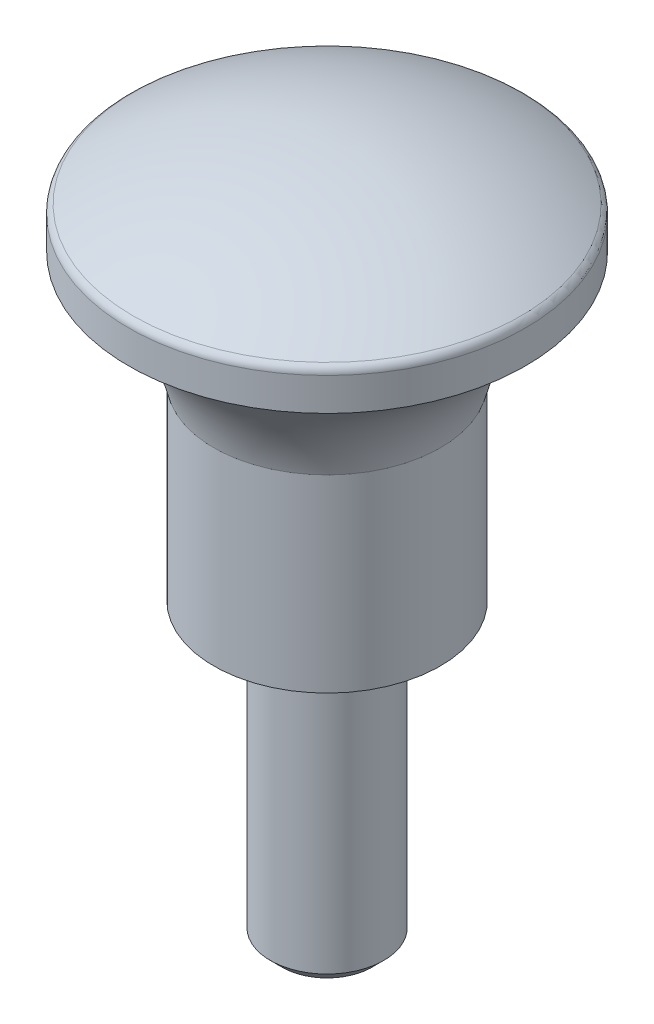
ISO-10303-21;
HEADER;
FILE_DESCRIPTION(('STEP AP214'),'2;1');
FILE_NAME('part.step','',(''),(''),'','','');
FILE_SCHEMA(('AUTOMOTIVE_DESIGN { 1 0 10303 214 1 1 1 1 }'));
ENDSEC;
DATA;
#1=APPLICATION_CONTEXT('core data for automotive mechanical design processes');
#2=APPLICATION_PROTOCOL_DEFINITION('international standard','automotive_design',2000,#1);
#3=PRODUCT_CONTEXT('',#1,'mechanical');
#4=PRODUCT('Part','Part','',(#3));
#5=PRODUCT_RELATED_PRODUCT_CATEGORY('part','',(#4));
#6=PRODUCT_DEFINITION_FORMATION('','',#4);
#7=PRODUCT_DEFINITION_CONTEXT('part definition',#1,'design');
#8=PRODUCT_DEFINITION('design','',#6,#7);
#9=PRODUCT_DEFINITION_SHAPE('','',#8);
#10=(LENGTH_UNIT() NAMED_UNIT(*) SI_UNIT(.MILLI.,.METRE.));
#11=(NAMED_UNIT(*) PLANE_ANGLE_UNIT() SI_UNIT($,.RADIAN.));
#12=(NAMED_UNIT(*) SI_UNIT($,.STERADIAN.) SOLID_ANGLE_UNIT());
#13=UNCERTAINTY_MEASURE_WITH_UNIT(LENGTH_MEASURE(1.E-05),#10,'distance_accuracy_value','');
#14=(GEOMETRIC_REPRESENTATION_CONTEXT(3) GLOBAL_UNCERTAINTY_ASSIGNED_CONTEXT((#13)) GLOBAL_UNIT_ASSIGNED_CONTEXT((#10,
#11,#12)) REPRESENTATION_CONTEXT('',''));
#15=CARTESIAN_POINT('',(0.,0.,0.));
#16=DIRECTION('',(0.,0.,1.));
#17=DIRECTION('',(1.,0.,0.));
#18=AXIS2_PLACEMENT_3D('',#15,#16,#17);
#19=CARTESIAN_POINT('',(0.,6.61343500000016,0.));
#20=DIRECTION('',(0.,-1.,0.));
#21=DIRECTION('',(0.,0.,-1.));
#22=AXIS2_PLACEMENT_3D('',#19,#20,#21);
#23=SPHERICAL_SURFACE('',#22,19.9999999999998);
#24=CARTESIAN_POINT('',(0.,23.7833519669571,0.));
#25=DIRECTION('',(0.,-1.,0.));
#26=DIRECTION('',(0.,0.,-1.));
#27=AXIS2_PLACEMENT_3D('',#24,#25,#26);
#28=CIRCLE('',#27,10.2564102564103);
#29=CARTESIAN_POINT('',(0.,23.7833519669571,-10.2564102564103));
#30=VERTEX_POINT('',#29);
#31=EDGE_CURVE('E10',#30,#30,#28,.T.);
#32=ORIENTED_EDGE('',*,*,#31,.F.);
#33=EDGE_LOOP('',(#32));
#34=FACE_BOUND('',#33,.T.);
#35=ADVANCED_FACE('F34',(#34),#23,.T.);
#36=CARTESIAN_POINT('',(0.,23.3541040427832,0.));
#37=DIRECTION('',(0.,-1.,0.));
#38=DIRECTION('',(0.,0.,-1.));
#39=AXIS2_PLACEMENT_3D('',#36,#37,#38);
#40=TOROIDAL_SURFACE('',#39,10.,0.499999999999994);
#41=ORIENTED_EDGE('',*,*,#31,.T.);
#42=EDGE_LOOP('',(#41));
#43=FACE_BOUND('',#42,.T.);
#44=CARTESIAN_POINT('',(0.,23.3541040427832,0.));
#45=DIRECTION('',(0.,-1.,0.));
#46=DIRECTION('',(0.,0.,-1.));
#47=AXIS2_PLACEMENT_3D('',#44,#45,#46);
#48=CIRCLE('',#47,10.5);
#49=CARTESIAN_POINT('',(0.,23.3541040427832,-10.5));
#50=VERTEX_POINT('',#49);
#51=EDGE_CURVE('E40',#50,#50,#48,.T.);
#52=ORIENTED_EDGE('',*,*,#51,.F.);
#53=EDGE_LOOP('',(#52));
#54=FACE_BOUND('',#53,.T.);
#55=ADVANCED_FACE('F82',(#43,#54),#40,.T.);
#56=CARTESIAN_POINT('',(0.,-10.,0.));
#57=DIRECTION('',(0.,-1.,0.));
#58=DIRECTION('',(0.,0.,-1.));
#59=AXIS2_PLACEMENT_3D('',#56,#57,#58);
#60=CYLINDRICAL_SURFACE('',#59,10.5);
#61=ORIENTED_EDGE('',*,*,#51,.T.);
#62=EDGE_LOOP('',(#61));
#63=FACE_BOUND('',#62,.T.);
#64=CARTESIAN_POINT('',(0.,21.613435,0.));
#65=DIRECTION('',(0.,-1.,0.));
#66=DIRECTION('',(0.,0.,-1.));
#67=AXIS2_PLACEMENT_3D('',#64,#65,#66);
#68=CIRCLE('',#67,10.5);
#69=CARTESIAN_POINT('',(0.,21.613435,-10.5));
#70=VERTEX_POINT('',#69);
#71=EDGE_CURVE('E44',#70,#70,#68,.T.);
#72=ORIENTED_EDGE('',*,*,#71,.F.);
#73=EDGE_LOOP('',(#72));
#74=FACE_BOUND('',#73,.T.);
#75=ADVANCED_FACE('F87',(#63,#74),#60,.T.);
#76=CARTESIAN_POINT('',(0.,13.7045145484139,0.));
#77=DIRECTION('',(0.,-1.,0.));
#78=DIRECTION('',(0.,0.,-1.));
#79=AXIS2_PLACEMENT_3D('',#76,#77,#78);
#80=TOROIDAL_SURFACE('',#79,14.7952272687814,9.00000000000001);
#81=ORIENTED_EDGE('',*,*,#71,.T.);
#82=EDGE_LOOP('',(#81));
#83=FACE_BOUND('',#82,.T.);
#84=CARTESIAN_POINT('',(0.,15.613435,0.));
#85=DIRECTION('',(0.,-1.,0.));
#86=DIRECTION('',(0.,0.,-1.));
#87=AXIS2_PLACEMENT_3D('',#84,#85,#86);
#88=CIRCLE('',#87,6.);
#89=CARTESIAN_POINT('',(0.,15.613435,-6.));
#90=VERTEX_POINT('',#89);
#91=EDGE_CURVE('E48',#90,#90,#88,.T.);
#92=ORIENTED_EDGE('',*,*,#91,.F.);
#93=EDGE_LOOP('',(#92));
#94=FACE_BOUND('',#93,.T.);
#95=ADVANCED_FACE('F91',(#83,#94),#80,.F.);
#96=CARTESIAN_POINT('',(0.,-10.,0.));
#97=DIRECTION('',(0.,-1.,0.));
#98=DIRECTION('',(0.,0.,-1.));
#99=AXIS2_PLACEMENT_3D('',#96,#97,#98);
#100=CYLINDRICAL_SURFACE('',#99,6.);
#101=ORIENTED_EDGE('',*,*,#91,.T.);
#102=EDGE_LOOP('',(#101));
#103=FACE_BOUND('',#102,.T.);
#104=CARTESIAN_POINT('',(0.,5.613435,0.));
#105=DIRECTION('',(0.,-1.,0.));
#106=DIRECTION('',(0.,0.,-1.));
#107=AXIS2_PLACEMENT_3D('',#104,#105,#106);
#108=CIRCLE('',#107,6.);
#109=CARTESIAN_POINT('',(0.,5.613435,-6.));
#110=VERTEX_POINT('',#109);
#111=EDGE_CURVE('E53',#110,#110,#108,.T.);
#112=ORIENTED_EDGE('',*,*,#111,.F.);
#113=EDGE_LOOP('',(#112));
#114=FACE_BOUND('',#113,.T.);
#115=ADVANCED_FACE('F97',(#103,#114),#100,.T.);
#116=CARTESIAN_POINT('',(0.,5.613435,-6.));
#117=DIRECTION('',(0.,-1.,0.));
#118=DIRECTION('',(0.,0.,-1.));
#119=AXIS2_PLACEMENT_3D('',#116,#117,#118);
#120=PLANE('',#119);
#121=ORIENTED_EDGE('',*,*,#111,.T.);
#122=EDGE_LOOP('',(#121));
#123=FACE_BOUND('',#122,.T.);
#124=CARTESIAN_POINT('',(0.,5.613435,0.));
#125=DIRECTION('',(0.,-1.,0.));
#126=DIRECTION('',(0.,0.,-1.));
#127=AXIS2_PLACEMENT_3D('',#124,#125,#126);
#128=CIRCLE('',#127,3.);
#129=CARTESIAN_POINT('',(0.,5.613435,-3.));
#130=VERTEX_POINT('',#129);
#131=EDGE_CURVE('E56',#130,#130,#128,.T.);
#132=ORIENTED_EDGE('',*,*,#131,.F.);
#133=EDGE_LOOP('',(#132));
#134=FACE_BOUND('',#133,.T.);
#135=ADVANCED_FACE('F78',(#123,#134),#120,.T.);
#136=CARTESIAN_POINT('',(0.,-10.,0.));
#137=DIRECTION('',(0.,-1.,0.));
#138=DIRECTION('',(0.,0.,-1.));
#139=AXIS2_PLACEMENT_3D('',#136,#137,#138);
#140=CYLINDRICAL_SURFACE('',#139,3.);
#141=ORIENTED_EDGE('',*,*,#131,.T.);
#142=EDGE_LOOP('',(#141));
#143=FACE_BOUND('',#142,.T.);
#144=CARTESIAN_POINT('',(0.,-9.386565,0.));
#145=DIRECTION('',(0.,-1.,0.));
#146=DIRECTION('',(0.,0.,-1.));
#147=AXIS2_PLACEMENT_3D('',#144,#145,#146);
#148=CIRCLE('',#147,3.);
#149=CARTESIAN_POINT('',(0.,-9.386565,-3.));
#150=VERTEX_POINT('',#149);
#151=EDGE_CURVE('E59',#150,#150,#148,.T.);
#152=ORIENTED_EDGE('',*,*,#151,.F.);
#153=EDGE_LOOP('',(#152));
#154=FACE_BOUND('',#153,.T.);
#155=ADVANCED_FACE('F70',(#143,#154),#140,.T.);
#156=CARTESIAN_POINT('',(0.,-10.,0.));
#157=DIRECTION('',(0.,1.,0.));
#158=DIRECTION('',(0.,0.,1.));
#159=AXIS2_PLACEMENT_3D('',#156,#157,#158);
#160=CONICAL_SURFACE('',#159,2.386565,0.785398163397449);
#161=ORIENTED_EDGE('',*,*,#151,.T.);
#162=EDGE_LOOP('',(#161));
#163=FACE_BOUND('',#162,.T.);
#164=CARTESIAN_POINT('',(0.,-10.,0.));
#165=DIRECTION('',(0.,-1.,0.));
#166=DIRECTION('',(0.,0.,-1.));
#167=AXIS2_PLACEMENT_3D('',#164,#165,#166);
#168=CIRCLE('',#167,2.386565);
#169=CARTESIAN_POINT('',(0.,-10.,-2.386565));
#170=VERTEX_POINT('',#169);
#171=EDGE_CURVE('E62',#170,#170,#168,.T.);
#172=ORIENTED_EDGE('',*,*,#171,.F.);
#173=EDGE_LOOP('',(#172));
#174=FACE_BOUND('',#173,.T.);
#175=ADVANCED_FACE('F68',(#163,#174),#160,.T.);
#176=CARTESIAN_POINT('',(0.,-10.,-2.386565));
#177=DIRECTION('',(0.,-1.,0.));
#178=DIRECTION('',(0.,0.,-1.));
#179=AXIS2_PLACEMENT_3D('',#176,#177,#178);
#180=PLANE('',#179);
#181=ORIENTED_EDGE('',*,*,#171,.T.);
#182=EDGE_LOOP('',(#181));
#183=FACE_BOUND('',#182,.T.);
#184=ADVANCED_FACE('F66',(#183),#180,.T.);
#185=CLOSED_SHELL('',(#35,#55,#75,#95,#115,#135,#155,#175,#184));
#186=MANIFOLD_SOLID_BREP('B2',#185);
#187=ADVANCED_BREP_SHAPE_REPRESENTATION('',(#18,#186),#14);
#188=SHAPE_DEFINITION_REPRESENTATION(#9,#187);
ENDSEC;
END-ISO-10303-21;
